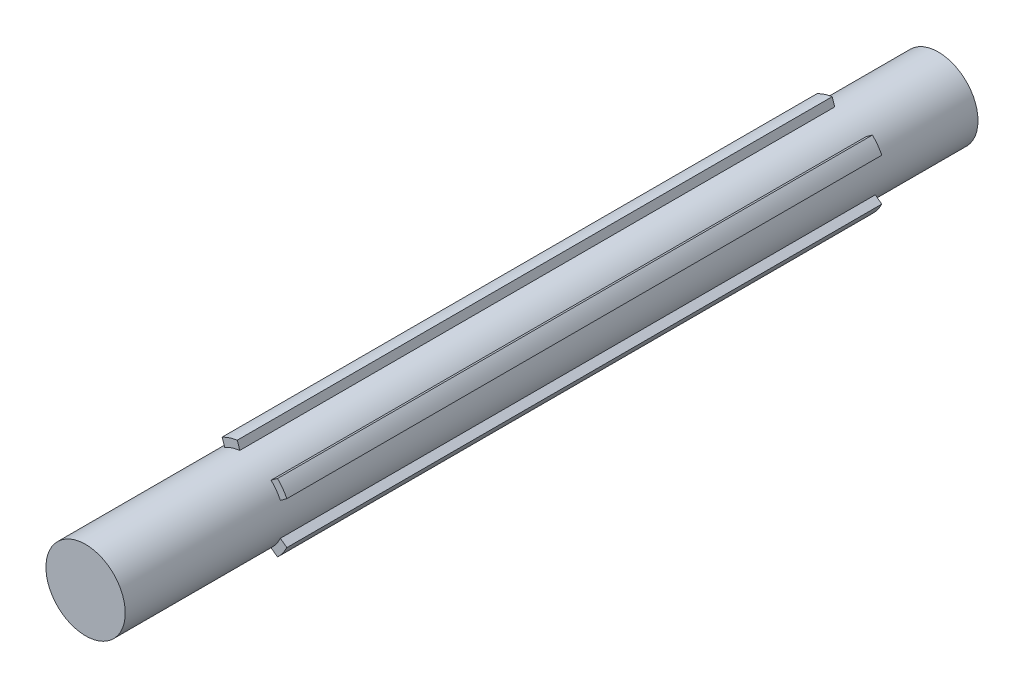
ISO-10303-21;
HEADER;
FILE_DESCRIPTION(('STEP AP214'),'2;1');
FILE_NAME('part.step','',(''),(''),'','','');
FILE_SCHEMA(('AUTOMOTIVE_DESIGN { 1 0 10303 214 1 1 1 1 }'));
ENDSEC;
DATA;
#1=APPLICATION_CONTEXT('core data for automotive mechanical design processes');
#2=APPLICATION_PROTOCOL_DEFINITION('international standard','automotive_design',2000,#1);
#3=PRODUCT_CONTEXT('',#1,'mechanical');
#4=PRODUCT('Part','Part','',(#3));
#5=PRODUCT_RELATED_PRODUCT_CATEGORY('part','',(#4));
#6=PRODUCT_DEFINITION_FORMATION('','',#4);
#7=PRODUCT_DEFINITION_CONTEXT('part definition',#1,'design');
#8=PRODUCT_DEFINITION('design','',#6,#7);
#9=PRODUCT_DEFINITION_SHAPE('','',#8);
#10=(LENGTH_UNIT() NAMED_UNIT(*) SI_UNIT(.MILLI.,.METRE.));
#11=(NAMED_UNIT(*) PLANE_ANGLE_UNIT() SI_UNIT($,.RADIAN.));
#12=(NAMED_UNIT(*) SI_UNIT($,.STERADIAN.) SOLID_ANGLE_UNIT());
#13=UNCERTAINTY_MEASURE_WITH_UNIT(LENGTH_MEASURE(1.E-05),#10,'distance_accuracy_value','');
#14=(GEOMETRIC_REPRESENTATION_CONTEXT(3) GLOBAL_UNCERTAINTY_ASSIGNED_CONTEXT((#13)) GLOBAL_UNIT_ASSIGNED_CONTEXT((#10,
#11,#12)) REPRESENTATION_CONTEXT('',''));
#15=CARTESIAN_POINT('',(0.,0.,0.));
#16=DIRECTION('',(0.,0.,1.));
#17=DIRECTION('',(1.,0.,0.));
#18=AXIS2_PLACEMENT_3D('',#15,#16,#17);
#19=CARTESIAN_POINT('',(0.,0.,-215.));
#20=DIRECTION('',(0.,0.,1.));
#21=DIRECTION('',(1.,0.,0.));
#22=AXIS2_PLACEMENT_3D('',#19,#20,#21);
#23=CYLINDRICAL_SURFACE('',#22,10.);
#24=CARTESIAN_POINT('',(0.,0.,-215.));
#25=DIRECTION('',(0.,0.,1.));
#26=DIRECTION('',(1.,0.,0.));
#27=AXIS2_PLACEMENT_3D('',#24,#25,#26);
#28=CIRCLE('',#27,10.);
#29=CARTESIAN_POINT('',(10.,0.,-215.));
#30=VERTEX_POINT('',#29);
#31=EDGE_CURVE('E11',#30,#30,#28,.T.);
#32=ORIENTED_EDGE('',*,*,#31,.T.);
#33=EDGE_LOOP('',(#32));
#34=FACE_BOUND('',#33,.T.);
#35=CARTESIAN_POINT('',(0.,0.,0.));
#36=DIRECTION('',(0.,0.,1.));
#37=DIRECTION('',(1.,0.,0.));
#38=AXIS2_PLACEMENT_3D('',#35,#36,#37);
#39=CIRCLE('',#38,10.);
#40=CARTESIAN_POINT('',(10.,0.,0.));
#41=VERTEX_POINT('',#40);
#42=EDGE_CURVE('E48',#41,#41,#39,.T.);
#43=ORIENTED_EDGE('',*,*,#42,.F.);
#44=EDGE_LOOP('',(#43));
#45=FACE_BOUND('',#44,.T.);
#46=DIRECTION('',(0.,0.,1.));
#47=VECTOR('',#46,1.);
#48=CARTESIAN_POINT('',(-9.79795897113271,-2.,-190.));
#49=LINE('',#48,#47);
#50=CARTESIAN_POINT('',(-9.79795897113271,-2.,-190.));
#51=VERTEX_POINT('',#50);
#52=CARTESIAN_POINT('',(-9.79795897113271,-2.,-40.));
#53=VERTEX_POINT('',#52);
#54=EDGE_CURVE('E392',#51,#53,#49,.T.);
#55=ORIENTED_EDGE('',*,*,#54,.F.);
#56=CARTESIAN_POINT('',(0.,0.,-190.));
#57=DIRECTION('',(0.,0.,1.));
#58=DIRECTION('',(1.,0.,0.));
#59=AXIS2_PLACEMENT_3D('',#56,#57,#58);
#60=CIRCLE('',#59,10.);
#61=CARTESIAN_POINT('',(-9.79795897113271,2.,-190.));
#62=VERTEX_POINT('',#61);
#63=EDGE_CURVE('E361',#62,#51,#60,.T.);
#64=ORIENTED_EDGE('',*,*,#63,.F.);
#65=DIRECTION('',(0.,0.,1.));
#66=VECTOR('',#65,1.);
#67=CARTESIAN_POINT('',(-9.79795897113271,2.,-190.));
#68=LINE('',#67,#66);
#69=CARTESIAN_POINT('',(-9.79795897113271,2.,-40.));
#70=VERTEX_POINT('',#69);
#71=EDGE_CURVE('E378',#62,#70,#68,.T.);
#72=ORIENTED_EDGE('',*,*,#71,.T.);
#73=CARTESIAN_POINT('',(0.,0.,-40.));
#74=DIRECTION('',(0.,0.,1.));
#75=DIRECTION('',(1.,0.,0.));
#76=AXIS2_PLACEMENT_3D('',#73,#74,#75);
#77=CIRCLE('',#76,10.);
#78=EDGE_CURVE('E352',#70,#53,#77,.T.);
#79=ORIENTED_EDGE('',*,*,#78,.T.);
#80=EDGE_LOOP('',(#55,#64,#72,#79));
#81=FACE_BOUND('',#80,.T.);
#82=DIRECTION('',(0.,0.,1.));
#83=VECTOR('',#82,1.);
#84=CARTESIAN_POINT('',(-4.92984886485877,8.70037873713845,-190.));
#85=LINE('',#84,#83);
#86=CARTESIAN_POINT('',(-4.92984886485877,8.70037873713844,-190.));
#87=VERTEX_POINT('',#86);
#88=CARTESIAN_POINT('',(-4.92984886485877,8.70037873713844,-40.));
#89=VERTEX_POINT('',#88);
#90=EDGE_CURVE('E348',#87,#89,#85,.T.);
#91=ORIENTED_EDGE('',*,*,#90,.F.);
#92=CARTESIAN_POINT('',(0.,0.,-190.));
#93=DIRECTION('',(0.,0.,1.));
#94=DIRECTION('',(1.,0.,0.));
#95=AXIS2_PLACEMENT_3D('',#92,#93,#94);
#96=CIRCLE('',#95,10.);
#97=CARTESIAN_POINT('',(-1.12562279967815,9.93644671463823,-190.));
#98=VERTEX_POINT('',#97);
#99=EDGE_CURVE('E317',#98,#87,#96,.T.);
#100=ORIENTED_EDGE('',*,*,#99,.F.);
#101=DIRECTION('',(0.,0.,1.));
#102=VECTOR('',#101,1.);
#103=CARTESIAN_POINT('',(-1.12562279967815,9.93644671463823,-190.));
#104=LINE('',#103,#102);
#105=CARTESIAN_POINT('',(-1.12562279967815,9.93644671463823,-40.));
#106=VERTEX_POINT('',#105);
#107=EDGE_CURVE('E334',#98,#106,#104,.T.);
#108=ORIENTED_EDGE('',*,*,#107,.T.);
#109=CARTESIAN_POINT('',(0.,0.,-40.));
#110=DIRECTION('',(0.,0.,1.));
#111=DIRECTION('',(1.,0.,0.));
#112=AXIS2_PLACEMENT_3D('',#109,#110,#111);
#113=CIRCLE('',#112,10.);
#114=EDGE_CURVE('E308',#106,#89,#113,.T.);
#115=ORIENTED_EDGE('',*,*,#114,.T.);
#116=EDGE_LOOP('',(#91,#100,#108,#115));
#117=FACE_BOUND('',#116,.T.);
#118=DIRECTION('',(0.,0.,1.));
#119=VECTOR('',#118,1.);
#120=CARTESIAN_POINT('',(6.75114481324993,7.3771297745484,-190.));
#121=LINE('',#120,#119);
#122=CARTESIAN_POINT('',(6.75114481324993,7.3771297745484,-190.));
#123=VERTEX_POINT('',#122);
#124=CARTESIAN_POINT('',(6.75114481324993,7.3771297745484,-40.));
#125=VERTEX_POINT('',#124);
#126=EDGE_CURVE('E304',#123,#125,#121,.T.);
#127=ORIENTED_EDGE('',*,*,#126,.F.);
#128=CARTESIAN_POINT('',(0.,0.,-190.));
#129=DIRECTION('',(0.,0.,1.));
#130=DIRECTION('',(1.,0.,0.));
#131=AXIS2_PLACEMENT_3D('',#128,#129,#130);
#132=CIRCLE('',#131,10.);
#133=CARTESIAN_POINT('',(9.10228582241981,4.1410617970486,-190.));
#134=VERTEX_POINT('',#133);
#135=EDGE_CURVE('E273',#134,#123,#132,.T.);
#136=ORIENTED_EDGE('',*,*,#135,.F.);
#137=DIRECTION('',(0.,0.,1.));
#138=VECTOR('',#137,1.);
#139=CARTESIAN_POINT('',(9.10228582241981,4.1410617970486,-190.));
#140=LINE('',#139,#138);
#141=CARTESIAN_POINT('',(9.10228582241981,4.1410617970486,-40.));
#142=VERTEX_POINT('',#141);
#143=EDGE_CURVE('E290',#134,#142,#140,.T.);
#144=ORIENTED_EDGE('',*,*,#143,.T.);
#145=CARTESIAN_POINT('',(0.,0.,-40.));
#146=DIRECTION('',(0.,0.,1.));
#147=DIRECTION('',(1.,0.,0.));
#148=AXIS2_PLACEMENT_3D('',#145,#146,#147);
#149=CIRCLE('',#148,10.);
#150=EDGE_CURVE('E264',#142,#125,#149,.T.);
#151=ORIENTED_EDGE('',*,*,#150,.T.);
#152=EDGE_LOOP('',(#127,#136,#144,#151));
#153=FACE_BOUND('',#152,.T.);
#154=DIRECTION('',(0.,0.,1.));
#155=VECTOR('',#154,1.);
#156=CARTESIAN_POINT('',(9.10228582241975,-4.14106179704873,-190.));
#157=LINE('',#156,#155);
#158=CARTESIAN_POINT('',(9.10228582241975,-4.14106179704872,-190.));
#159=VERTEX_POINT('',#158);
#160=CARTESIAN_POINT('',(9.10228582241975,-4.14106179704873,-40.));
#161=VERTEX_POINT('',#160);
#162=EDGE_CURVE('E260',#159,#161,#157,.T.);
#163=ORIENTED_EDGE('',*,*,#162,.F.);
#164=CARTESIAN_POINT('',(0.,0.,-190.));
#165=DIRECTION('',(0.,0.,1.));
#166=DIRECTION('',(1.,0.,0.));
#167=AXIS2_PLACEMENT_3D('',#164,#165,#166);
#168=CIRCLE('',#167,10.);
#169=CARTESIAN_POINT('',(6.75114481324983,-7.3771297745485,-190.));
#170=VERTEX_POINT('',#169);
#171=EDGE_CURVE('E229',#170,#159,#168,.T.);
#172=ORIENTED_EDGE('',*,*,#171,.F.);
#173=DIRECTION('',(0.,0.,1.));
#174=VECTOR('',#173,1.);
#175=CARTESIAN_POINT('',(6.75114481324983,-7.3771297745485,-190.));
#176=LINE('',#175,#174);
#177=CARTESIAN_POINT('',(6.75114481324983,-7.3771297745485,-40.));
#178=VERTEX_POINT('',#177);
#179=EDGE_CURVE('E246',#170,#178,#176,.T.);
#180=ORIENTED_EDGE('',*,*,#179,.T.);
#181=CARTESIAN_POINT('',(0.,0.,-40.));
#182=DIRECTION('',(0.,0.,1.));
#183=DIRECTION('',(1.,0.,0.));
#184=AXIS2_PLACEMENT_3D('',#181,#182,#183);
#185=CIRCLE('',#184,10.);
#186=EDGE_CURVE('E224',#178,#161,#185,.T.);
#187=ORIENTED_EDGE('',*,*,#186,.T.);
#188=EDGE_LOOP('',(#163,#172,#180,#187));
#189=FACE_BOUND('',#188,.T.);
#190=DIRECTION('',(0.,0.,1.));
#191=VECTOR('',#190,1.);
#192=CARTESIAN_POINT('',(-1.12562279967829,-9.93644671463821,-190.));
#193=LINE('',#192,#191);
#194=CARTESIAN_POINT('',(-1.12562279967829,-9.93644671463821,-190.));
#195=VERTEX_POINT('',#194);
#196=CARTESIAN_POINT('',(-1.12562279967829,-9.93644671463821,-40.));
#197=VERTEX_POINT('',#196);
#198=EDGE_CURVE('E60',#195,#197,#193,.T.);
#199=ORIENTED_EDGE('',*,*,#198,.F.);
#200=CARTESIAN_POINT('',(0.,0.,-190.));
#201=DIRECTION('',(0.,0.,1.));
#202=DIRECTION('',(1.,0.,0.));
#203=AXIS2_PLACEMENT_3D('',#200,#201,#202);
#204=CIRCLE('',#203,10.);
#205=CARTESIAN_POINT('',(-4.92984886485889,-8.70037873713838,-190.));
#206=VERTEX_POINT('',#205);
#207=EDGE_CURVE('E64',#206,#195,#204,.T.);
#208=ORIENTED_EDGE('',*,*,#207,.F.);
#209=DIRECTION('',(0.,0.,1.));
#210=VECTOR('',#209,1.);
#211=CARTESIAN_POINT('',(-4.92984886485889,-8.70037873713838,-190.));
#212=LINE('',#211,#210);
#213=CARTESIAN_POINT('',(-4.92984886485889,-8.70037873713838,-40.));
#214=VERTEX_POINT('',#213);
#215=EDGE_CURVE('E193',#206,#214,#212,.T.);
#216=ORIENTED_EDGE('',*,*,#215,.T.);
#217=CARTESIAN_POINT('',(0.,0.,-40.));
#218=DIRECTION('',(0.,0.,1.));
#219=DIRECTION('',(1.,0.,0.));
#220=AXIS2_PLACEMENT_3D('',#217,#218,#219);
#221=CIRCLE('',#220,10.);
#222=EDGE_CURVE('E210',#214,#197,#221,.T.);
#223=ORIENTED_EDGE('',*,*,#222,.T.);
#224=EDGE_LOOP('',(#199,#208,#216,#223));
#225=FACE_BOUND('',#224,.T.);
#226=ADVANCED_FACE('F45',(#34,#45,#81,#117,#153,#189,#225),#23,.T.);
#227=CARTESIAN_POINT('',(0.,0.,-215.));
#228=DIRECTION('',(0.,0.,1.));
#229=DIRECTION('',(1.,0.,0.));
#230=AXIS2_PLACEMENT_3D('',#227,#228,#229);
#231=PLANE('',#230);
#232=ORIENTED_EDGE('',*,*,#31,.F.);
#233=EDGE_LOOP('',(#232));
#234=FACE_BOUND('',#233,.T.);
#235=ADVANCED_FACE('F433',(#234),#231,.F.);
#236=CARTESIAN_POINT('',(0.,0.,0.));
#237=DIRECTION('',(0.,0.,1.));
#238=DIRECTION('',(1.,0.,0.));
#239=AXIS2_PLACEMENT_3D('',#236,#237,#238);
#240=PLANE('',#239);
#241=ORIENTED_EDGE('',*,*,#42,.T.);
#242=EDGE_LOOP('',(#241));
#243=FACE_BOUND('',#242,.T.);
#244=ADVANCED_FACE('F430',(#243),#240,.T.);
#245=CARTESIAN_POINT('',(0.,-2.,-190.));
#246=DIRECTION('',(0.,-1.,0.));
#247=DIRECTION('',(0.,0.,-1.));
#248=AXIS2_PLACEMENT_3D('',#245,#246,#247);
#249=PLANE('',#248);
#250=DIRECTION('',(1.,0.,0.));
#251=VECTOR('',#250,1.);
#252=CARTESIAN_POINT('',(0.,-2.,-40.));
#253=LINE('',#252,#251);
#254=CARTESIAN_POINT('',(-11.8321595661992,-2.,-40.));
#255=VERTEX_POINT('',#254);
#256=EDGE_CURVE('E366',#255,#53,#253,.T.);
#257=ORIENTED_EDGE('',*,*,#256,.F.);
#258=DIRECTION('',(0.,0.,1.));
#259=VECTOR('',#258,1.);
#260=CARTESIAN_POINT('',(-11.8321595661992,-2.,-190.));
#261=LINE('',#260,#259);
#262=CARTESIAN_POINT('',(-11.8321595661992,-2.,-190.));
#263=VERTEX_POINT('',#262);
#264=EDGE_CURVE('E396',#263,#255,#261,.T.);
#265=ORIENTED_EDGE('',*,*,#264,.F.);
#266=DIRECTION('',(1.,0.,0.));
#267=VECTOR('',#266,1.);
#268=CARTESIAN_POINT('',(0.,-2.,-190.));
#269=LINE('',#268,#267);
#270=EDGE_CURVE('E374',#263,#51,#269,.T.);
#271=ORIENTED_EDGE('',*,*,#270,.T.);
#272=ORIENTED_EDGE('',*,*,#54,.T.);
#273=EDGE_LOOP('',(#257,#265,#271,#272));
#274=FACE_BOUND('',#273,.T.);
#275=ADVANCED_FACE('F416',(#274),#249,.T.);
#276=CARTESIAN_POINT('',(0.,0.,-190.));
#277=DIRECTION('',(0.,0.,1.));
#278=DIRECTION('',(1.,0.,0.));
#279=AXIS2_PLACEMENT_3D('',#276,#277,#278);
#280=CYLINDRICAL_SURFACE('',#279,12.);
#281=CARTESIAN_POINT('',(0.,0.,-40.));
#282=DIRECTION('',(0.,0.,1.));
#283=DIRECTION('',(1.,0.,0.));
#284=AXIS2_PLACEMENT_3D('',#281,#282,#283);
#285=CIRCLE('',#284,12.);
#286=CARTESIAN_POINT('',(-11.8321595661992,2.,-40.));
#287=VERTEX_POINT('',#286);
#288=EDGE_CURVE('E385',#287,#255,#285,.T.);
#289=ORIENTED_EDGE('',*,*,#288,.F.);
#290=DIRECTION('',(0.,0.,1.));
#291=VECTOR('',#290,1.);
#292=CARTESIAN_POINT('',(-11.8321595661992,2.,-190.));
#293=LINE('',#292,#291);
#294=CARTESIAN_POINT('',(-11.8321595661992,2.,-190.));
#295=VERTEX_POINT('',#294);
#296=EDGE_CURVE('E399',#295,#287,#293,.T.);
#297=ORIENTED_EDGE('',*,*,#296,.F.);
#298=CARTESIAN_POINT('',(0.,0.,-190.));
#299=DIRECTION('',(0.,0.,1.));
#300=DIRECTION('',(1.,0.,0.));
#301=AXIS2_PLACEMENT_3D('',#298,#299,#300);
#302=CIRCLE('',#301,12.);
#303=EDGE_CURVE('E370',#295,#263,#302,.T.);
#304=ORIENTED_EDGE('',*,*,#303,.T.);
#305=ORIENTED_EDGE('',*,*,#264,.T.);
#306=EDGE_LOOP('',(#289,#297,#304,#305));
#307=FACE_BOUND('',#306,.T.);
#308=ADVANCED_FACE('F422',(#307),#280,.T.);
#309=CARTESIAN_POINT('',(0.,2.,-190.));
#310=DIRECTION('',(0.,-1.,0.));
#311=DIRECTION('',(0.,0.,-1.));
#312=AXIS2_PLACEMENT_3D('',#309,#310,#311);
#313=PLANE('',#312);
#314=DIRECTION('',(1.,0.,0.));
#315=VECTOR('',#314,1.);
#316=CARTESIAN_POINT('',(0.,2.,-40.));
#317=LINE('',#316,#315);
#318=EDGE_CURVE('E381',#287,#70,#317,.T.);
#319=ORIENTED_EDGE('',*,*,#318,.T.);
#320=ORIENTED_EDGE('',*,*,#71,.F.);
#321=DIRECTION('',(1.,0.,0.));
#322=VECTOR('',#321,1.);
#323=CARTESIAN_POINT('',(0.,2.,-190.));
#324=LINE('',#323,#322);
#325=EDGE_CURVE('E365',#295,#62,#324,.T.);
#326=ORIENTED_EDGE('',*,*,#325,.F.);
#327=ORIENTED_EDGE('',*,*,#296,.T.);
#328=EDGE_LOOP('',(#319,#320,#326,#327));
#329=FACE_BOUND('',#328,.T.);
#330=ADVANCED_FACE('F410',(#329),#313,.F.);
#331=CARTESIAN_POINT('',(0.,0.,-190.));
#332=DIRECTION('',(0.,0.,1.));
#333=DIRECTION('',(1.,0.,0.));
#334=AXIS2_PLACEMENT_3D('',#331,#332,#333);
#335=PLANE('',#334);
#336=ORIENTED_EDGE('',*,*,#63,.T.);
#337=ORIENTED_EDGE('',*,*,#270,.F.);
#338=ORIENTED_EDGE('',*,*,#303,.F.);
#339=ORIENTED_EDGE('',*,*,#325,.T.);
#340=EDGE_LOOP('',(#336,#337,#338,#339));
#341=FACE_BOUND('',#340,.T.);
#342=ADVANCED_FACE('F419',(#341),#335,.F.);
#343=CARTESIAN_POINT('',(0.,0.,-40.));
#344=DIRECTION('',(0.,0.,1.));
#345=DIRECTION('',(1.,0.,0.));
#346=AXIS2_PLACEMENT_3D('',#343,#344,#345);
#347=PLANE('',#346);
#348=ORIENTED_EDGE('',*,*,#78,.F.);
#349=ORIENTED_EDGE('',*,*,#318,.F.);
#350=ORIENTED_EDGE('',*,*,#288,.T.);
#351=ORIENTED_EDGE('',*,*,#256,.T.);
#352=EDGE_LOOP('',(#348,#349,#350,#351));
#353=FACE_BOUND('',#352,.T.);
#354=ADVANCED_FACE('F413',(#353),#347,.T.);
#355=CARTESIAN_POINT('',(-1.90211303259031,-0.61803398874989,-190.));
#356=DIRECTION('',(-0.951056516295154,-0.309016994374945,0.));
#357=DIRECTION('',(0.309016994374945,-0.951056516295155,0.));
#358=AXIS2_PLACEMENT_3D('',#355,#356,#357);
#359=PLANE('',#358);
#360=DIRECTION('',(0.309016994374945,-0.951056516295155,0.));
#361=VECTOR('',#360,1.);
#362=CARTESIAN_POINT('',(-1.90211303259031,-0.61803398874989,-40.));
#363=LINE('',#362,#361);
#364=CARTESIAN_POINT('',(-5.55845141870195,10.6350184685279,-40.));
#365=VERTEX_POINT('',#364);
#366=EDGE_CURVE('E322',#365,#89,#363,.T.);
#367=ORIENTED_EDGE('',*,*,#366,.F.);
#368=DIRECTION('',(0.,0.,1.));
#369=VECTOR('',#368,1.);
#370=CARTESIAN_POINT('',(-5.55845141870195,10.6350184685279,-190.));
#371=LINE('',#370,#369);
#372=CARTESIAN_POINT('',(-5.55845141870195,10.6350184685279,-190.));
#373=VERTEX_POINT('',#372);
#374=EDGE_CURVE('E353',#373,#365,#371,.T.);
#375=ORIENTED_EDGE('',*,*,#374,.F.);
#376=DIRECTION('',(0.309016994374945,-0.951056516295155,0.));
#377=VECTOR('',#376,1.);
#378=CARTESIAN_POINT('',(-1.90211303259031,-0.61803398874989,-190.));
#379=LINE('',#378,#377);
#380=EDGE_CURVE('E330',#373,#87,#379,.T.);
#381=ORIENTED_EDGE('',*,*,#380,.T.);
#382=ORIENTED_EDGE('',*,*,#90,.T.);
#383=EDGE_LOOP('',(#367,#375,#381,#382));
#384=FACE_BOUND('',#383,.T.);
#385=ADVANCED_FACE('F489',(#384),#359,.T.);
#386=CARTESIAN_POINT('',(0.,0.,-190.));
#387=DIRECTION('',(0.,0.,1.));
#388=DIRECTION('',(1.,0.,0.));
#389=AXIS2_PLACEMENT_3D('',#386,#387,#388);
#390=CYLINDRICAL_SURFACE('',#389,12.);
#391=CARTESIAN_POINT('',(0.,0.,-40.));
#392=DIRECTION('',(0.,0.,1.));
#393=DIRECTION('',(1.,0.,0.));
#394=AXIS2_PLACEMENT_3D('',#391,#392,#393);
#395=CIRCLE('',#394,12.);
#396=CARTESIAN_POINT('',(-1.75422535352133,11.8710864460277,-40.));
#397=VERTEX_POINT('',#396);
#398=EDGE_CURVE('E341',#397,#365,#395,.T.);
#399=ORIENTED_EDGE('',*,*,#398,.F.);
#400=DIRECTION('',(0.,0.,1.));
#401=VECTOR('',#400,1.);
#402=CARTESIAN_POINT('',(-1.75422535352133,11.8710864460277,-190.));
#403=LINE('',#402,#401);
#404=CARTESIAN_POINT('',(-1.75422535352133,11.8710864460277,-190.));
#405=VERTEX_POINT('',#404);
#406=EDGE_CURVE('E356',#405,#397,#403,.T.);
#407=ORIENTED_EDGE('',*,*,#406,.F.);
#408=CARTESIAN_POINT('',(0.,0.,-190.));
#409=DIRECTION('',(0.,0.,1.));
#410=DIRECTION('',(1.,0.,0.));
#411=AXIS2_PLACEMENT_3D('',#408,#409,#410);
#412=CIRCLE('',#411,12.);
#413=EDGE_CURVE('E326',#405,#373,#412,.T.);
#414=ORIENTED_EDGE('',*,*,#413,.T.);
#415=ORIENTED_EDGE('',*,*,#374,.T.);
#416=EDGE_LOOP('',(#399,#407,#414,#415));
#417=FACE_BOUND('',#416,.T.);
#418=ADVANCED_FACE('F499',(#417),#390,.T.);
#419=CARTESIAN_POINT('',(1.90211303259031,0.618033988749889,-190.));
#420=DIRECTION('',(-0.951056516295155,-0.309016994374945,0.));
#421=DIRECTION('',(0.309016994374945,-0.951056516295155,0.));
#422=AXIS2_PLACEMENT_3D('',#419,#420,#421);
#423=PLANE('',#422);
#424=DIRECTION('',(0.309016994374945,-0.951056516295155,0.));
#425=VECTOR('',#424,1.);
#426=CARTESIAN_POINT('',(1.90211303259031,0.618033988749889,-40.));
#427=LINE('',#426,#425);
#428=EDGE_CURVE('E337',#397,#106,#427,.T.);
#429=ORIENTED_EDGE('',*,*,#428,.T.);
#430=ORIENTED_EDGE('',*,*,#107,.F.);
#431=DIRECTION('',(0.309016994374945,-0.951056516295155,0.));
#432=VECTOR('',#431,1.);
#433=CARTESIAN_POINT('',(1.90211303259031,0.618033988749889,-190.));
#434=LINE('',#433,#432);
#435=EDGE_CURVE('E321',#405,#98,#434,.T.);
#436=ORIENTED_EDGE('',*,*,#435,.F.);
#437=ORIENTED_EDGE('',*,*,#406,.T.);
#438=EDGE_LOOP('',(#429,#430,#436,#437));
#439=FACE_BOUND('',#438,.T.);
#440=ADVANCED_FACE('F510',(#439),#423,.F.);
#441=CARTESIAN_POINT('',(0.,0.,-190.));
#442=DIRECTION('',(0.,0.,1.));
#443=DIRECTION('',(1.,0.,0.));
#444=AXIS2_PLACEMENT_3D('',#441,#442,#443);
#445=PLANE('',#444);
#446=ORIENTED_EDGE('',*,*,#99,.T.);
#447=ORIENTED_EDGE('',*,*,#380,.F.);
#448=ORIENTED_EDGE('',*,*,#413,.F.);
#449=ORIENTED_EDGE('',*,*,#435,.T.);
#450=EDGE_LOOP('',(#446,#447,#448,#449));
#451=FACE_BOUND('',#450,.T.);
#452=ADVANCED_FACE('F521',(#451),#445,.F.);
#453=CARTESIAN_POINT('',(0.,0.,-40.));
#454=DIRECTION('',(0.,0.,1.));
#455=DIRECTION('',(1.,0.,0.));
#456=AXIS2_PLACEMENT_3D('',#453,#454,#455);
#457=PLANE('',#456);
#458=ORIENTED_EDGE('',*,*,#114,.F.);
#459=ORIENTED_EDGE('',*,*,#428,.F.);
#460=ORIENTED_EDGE('',*,*,#398,.T.);
#461=ORIENTED_EDGE('',*,*,#366,.T.);
#462=EDGE_LOOP('',(#458,#459,#460,#461));
#463=FACE_BOUND('',#462,.T.);
#464=ADVANCED_FACE('F532',(#463),#457,.T.);
#465=CARTESIAN_POINT('',(-1.17557050458494,1.6180339887499,-190.));
#466=DIRECTION('',(-0.587785252292469,0.809016994374951,0.));
#467=DIRECTION('',(-0.809016994374951,-0.587785252292469,0.));
#468=AXIS2_PLACEMENT_3D('',#465,#466,#467);
#469=PLANE('',#468);
#470=DIRECTION('',(-0.809016994374951,-0.587785252292469,0.));
#471=VECTOR('',#470,1.);
#472=CARTESIAN_POINT('',(-1.17557050458494,1.6180339887499,-40.));
#473=LINE('',#472,#471);
#474=CARTESIAN_POINT('',(8.39684766462639,8.57280288453307,-40.));
#475=VERTEX_POINT('',#474);
#476=EDGE_CURVE('E278',#475,#125,#473,.T.);
#477=ORIENTED_EDGE('',*,*,#476,.F.);
#478=DIRECTION('',(0.,0.,1.));
#479=VECTOR('',#478,1.);
#480=CARTESIAN_POINT('',(8.39684766462639,8.57280288453307,-190.));
#481=LINE('',#480,#479);
#482=CARTESIAN_POINT('',(8.39684766462639,8.57280288453307,-190.));
#483=VERTEX_POINT('',#482);
#484=EDGE_CURVE('E309',#483,#475,#481,.T.);
#485=ORIENTED_EDGE('',*,*,#484,.F.);
#486=DIRECTION('',(-0.809016994374951,-0.587785252292469,0.));
#487=VECTOR('',#486,1.);
#488=CARTESIAN_POINT('',(-1.17557050458494,1.6180339887499,-190.));
#489=LINE('',#488,#487);
#490=EDGE_CURVE('E286',#483,#123,#489,.T.);
#491=ORIENTED_EDGE('',*,*,#490,.T.);
#492=ORIENTED_EDGE('',*,*,#126,.T.);
#493=EDGE_LOOP('',(#477,#485,#491,#492));
#494=FACE_BOUND('',#493,.T.);
#495=ADVANCED_FACE('F543',(#494),#469,.T.);
#496=CARTESIAN_POINT('',(0.,0.,-190.));
#497=DIRECTION('',(0.,0.,1.));
#498=DIRECTION('',(1.,0.,0.));
#499=AXIS2_PLACEMENT_3D('',#496,#497,#498);
#500=CYLINDRICAL_SURFACE('',#499,12.);
#501=CARTESIAN_POINT('',(0.,0.,-40.));
#502=DIRECTION('',(0.,0.,1.));
#503=DIRECTION('',(1.,0.,0.));
#504=AXIS2_PLACEMENT_3D('',#501,#502,#503);
#505=CIRCLE('',#504,12.);
#506=CARTESIAN_POINT('',(10.7479886737963,5.33673490703326,-40.));
#507=VERTEX_POINT('',#506);
#508=EDGE_CURVE('E297',#507,#475,#505,.T.);
#509=ORIENTED_EDGE('',*,*,#508,.F.);
#510=DIRECTION('',(0.,0.,1.));
#511=VECTOR('',#510,1.);
#512=CARTESIAN_POINT('',(10.7479886737963,5.33673490703326,-190.));
#513=LINE('',#512,#511);
#514=CARTESIAN_POINT('',(10.7479886737963,5.33673490703326,-190.));
#515=VERTEX_POINT('',#514);
#516=EDGE_CURVE('E312',#515,#507,#513,.T.);
#517=ORIENTED_EDGE('',*,*,#516,.F.);
#518=CARTESIAN_POINT('',(0.,0.,-190.));
#519=DIRECTION('',(0.,0.,1.));
#520=DIRECTION('',(1.,0.,0.));
#521=AXIS2_PLACEMENT_3D('',#518,#519,#520);
#522=CIRCLE('',#521,12.);
#523=EDGE_CURVE('E282',#515,#483,#522,.T.);
#524=ORIENTED_EDGE('',*,*,#523,.T.);
#525=ORIENTED_EDGE('',*,*,#484,.T.);
#526=EDGE_LOOP('',(#509,#517,#524,#525));
#527=FACE_BOUND('',#526,.T.);
#528=ADVANCED_FACE('F554',(#527),#500,.T.);
#529=CARTESIAN_POINT('',(1.17557050458493,-1.6180339887499,-190.));
#530=DIRECTION('',(-0.587785252292468,0.809016994374951,0.));
#531=DIRECTION('',(-0.809016994374951,-0.587785252292468,0.));
#532=AXIS2_PLACEMENT_3D('',#529,#530,#531);
#533=PLANE('',#532);
#534=DIRECTION('',(-0.809016994374951,-0.587785252292468,0.));
#535=VECTOR('',#534,1.);
#536=CARTESIAN_POINT('',(1.17557050458493,-1.6180339887499,-40.));
#537=LINE('',#536,#535);
#538=EDGE_CURVE('E293',#507,#142,#537,.T.);
#539=ORIENTED_EDGE('',*,*,#538,.T.);
#540=ORIENTED_EDGE('',*,*,#143,.F.);
#541=DIRECTION('',(-0.809016994374951,-0.587785252292468,0.));
#542=VECTOR('',#541,1.);
#543=CARTESIAN_POINT('',(1.17557050458493,-1.6180339887499,-190.));
#544=LINE('',#543,#542);
#545=EDGE_CURVE('E277',#515,#134,#544,.T.);
#546=ORIENTED_EDGE('',*,*,#545,.F.);
#547=ORIENTED_EDGE('',*,*,#516,.T.);
#548=EDGE_LOOP('',(#539,#540,#546,#547));
#549=FACE_BOUND('',#548,.T.);
#550=ADVANCED_FACE('F565',(#549),#533,.F.);
#551=CARTESIAN_POINT('',(0.,0.,-190.));
#552=DIRECTION('',(0.,0.,1.));
#553=DIRECTION('',(1.,0.,0.));
#554=AXIS2_PLACEMENT_3D('',#551,#552,#553);
#555=PLANE('',#554);
#556=ORIENTED_EDGE('',*,*,#135,.T.);
#557=ORIENTED_EDGE('',*,*,#490,.F.);
#558=ORIENTED_EDGE('',*,*,#523,.F.);
#559=ORIENTED_EDGE('',*,*,#545,.T.);
#560=EDGE_LOOP('',(#556,#557,#558,#559));
#561=FACE_BOUND('',#560,.T.);
#562=ADVANCED_FACE('F576',(#561),#555,.F.);
#563=CARTESIAN_POINT('',(0.,0.,-40.));
#564=DIRECTION('',(0.,0.,1.));
#565=DIRECTION('',(1.,0.,0.));
#566=AXIS2_PLACEMENT_3D('',#563,#564,#565);
#567=PLANE('',#566);
#568=ORIENTED_EDGE('',*,*,#150,.F.);
#569=ORIENTED_EDGE('',*,*,#538,.F.);
#570=ORIENTED_EDGE('',*,*,#508,.T.);
#571=ORIENTED_EDGE('',*,*,#476,.T.);
#572=EDGE_LOOP('',(#568,#569,#570,#571));
#573=FACE_BOUND('',#572,.T.);
#574=ADVANCED_FACE('F587',(#573),#567,.T.);
#575=CARTESIAN_POINT('',(1.17557050458496,1.61803398874989,-190.));
#576=DIRECTION('',(0.58778525229248,0.809016994374942,0.));
#577=DIRECTION('',(-0.809016994374942,0.58778525229248,0.));
#578=AXIS2_PLACEMENT_3D('',#575,#576,#577);
#579=PLANE('',#578);
#580=DIRECTION('',(-0.809016994374942,0.58778525229248,0.));
#581=VECTOR('',#580,1.);
#582=CARTESIAN_POINT('',(1.17557050458496,1.61803398874989,-40.));
#583=LINE('',#582,#581);
#584=CARTESIAN_POINT('',(10.7479886737962,-5.33673490703341,-40.));
#585=VERTEX_POINT('',#584);
#586=EDGE_CURVE('E234',#585,#161,#583,.T.);
#587=ORIENTED_EDGE('',*,*,#586,.F.);
#588=DIRECTION('',(0.,0.,1.));
#589=VECTOR('',#588,1.);
#590=CARTESIAN_POINT('',(10.7479886737962,-5.33673490703341,-190.));
#591=LINE('',#590,#589);
#592=CARTESIAN_POINT('',(10.7479886737962,-5.33673490703341,-190.));
#593=VERTEX_POINT('',#592);
#594=EDGE_CURVE('E265',#593,#585,#591,.T.);
#595=ORIENTED_EDGE('',*,*,#594,.F.);
#596=DIRECTION('',(-0.809016994374942,0.58778525229248,0.));
#597=VECTOR('',#596,1.);
#598=CARTESIAN_POINT('',(1.17557050458496,1.61803398874989,-190.));
#599=LINE('',#598,#597);
#600=EDGE_CURVE('E242',#593,#159,#599,.T.);
#601=ORIENTED_EDGE('',*,*,#600,.T.);
#602=ORIENTED_EDGE('',*,*,#162,.T.);
#603=EDGE_LOOP('',(#587,#595,#601,#602));
#604=FACE_BOUND('',#603,.T.);
#605=ADVANCED_FACE('F598',(#604),#579,.T.);
#606=CARTESIAN_POINT('',(0.,0.,-190.));
#607=DIRECTION('',(0.,0.,1.));
#608=DIRECTION('',(1.,0.,0.));
#609=AXIS2_PLACEMENT_3D('',#606,#607,#608);
#610=CYLINDRICAL_SURFACE('',#609,12.);
#611=CARTESIAN_POINT('',(0.,0.,-40.));
#612=DIRECTION('',(0.,0.,1.));
#613=DIRECTION('',(1.,0.,0.));
#614=AXIS2_PLACEMENT_3D('',#611,#612,#613);
#615=CIRCLE('',#614,12.);
#616=CARTESIAN_POINT('',(8.39684766462627,-8.57280288453318,-40.));
#617=VERTEX_POINT('',#616);
#618=EDGE_CURVE('E253',#617,#585,#615,.T.);
#619=ORIENTED_EDGE('',*,*,#618,.F.);
#620=DIRECTION('',(0.,0.,1.));
#621=VECTOR('',#620,1.);
#622=CARTESIAN_POINT('',(8.39684766462627,-8.57280288453318,-190.));
#623=LINE('',#622,#621);
#624=CARTESIAN_POINT('',(8.39684766462627,-8.57280288453318,-190.));
#625=VERTEX_POINT('',#624);
#626=EDGE_CURVE('E268',#625,#617,#623,.T.);
#627=ORIENTED_EDGE('',*,*,#626,.F.);
#628=CARTESIAN_POINT('',(0.,0.,-190.));
#629=DIRECTION('',(0.,0.,1.));
#630=DIRECTION('',(1.,0.,0.));
#631=AXIS2_PLACEMENT_3D('',#628,#629,#630);
#632=CIRCLE('',#631,12.);
#633=EDGE_CURVE('E238',#625,#593,#632,.T.);
#634=ORIENTED_EDGE('',*,*,#633,.T.);
#635=ORIENTED_EDGE('',*,*,#594,.T.);
#636=EDGE_LOOP('',(#619,#627,#634,#635));
#637=FACE_BOUND('',#636,.T.);
#638=ADVANCED_FACE('F609',(#637),#610,.T.);
#639=CARTESIAN_POINT('',(-1.17557050458496,-1.61803398874989,-190.));
#640=DIRECTION('',(0.58778525229248,0.809016994374942,0.));
#641=DIRECTION('',(-0.809016994374943,0.58778525229248,0.));
#642=AXIS2_PLACEMENT_3D('',#639,#640,#641);
#643=PLANE('',#642);
#644=DIRECTION('',(-0.809016994374943,0.58778525229248,0.));
#645=VECTOR('',#644,1.);
#646=CARTESIAN_POINT('',(-1.17557050458496,-1.61803398874989,-40.));
#647=LINE('',#646,#645);
#648=EDGE_CURVE('E249',#617,#178,#647,.T.);
#649=ORIENTED_EDGE('',*,*,#648,.T.);
#650=ORIENTED_EDGE('',*,*,#179,.F.);
#651=DIRECTION('',(-0.809016994374943,0.58778525229248,0.));
#652=VECTOR('',#651,1.);
#653=CARTESIAN_POINT('',(-1.17557050458496,-1.61803398874989,-190.));
#654=LINE('',#653,#652);
#655=EDGE_CURVE('E233',#625,#170,#654,.T.);
#656=ORIENTED_EDGE('',*,*,#655,.F.);
#657=ORIENTED_EDGE('',*,*,#626,.T.);
#658=EDGE_LOOP('',(#649,#650,#656,#657));
#659=FACE_BOUND('',#658,.T.);
#660=ADVANCED_FACE('F620',(#659),#643,.F.);
#661=CARTESIAN_POINT('',(0.,0.,-190.));
#662=DIRECTION('',(0.,0.,1.));
#663=DIRECTION('',(1.,0.,0.));
#664=AXIS2_PLACEMENT_3D('',#661,#662,#663);
#665=PLANE('',#664);
#666=ORIENTED_EDGE('',*,*,#171,.T.);
#667=ORIENTED_EDGE('',*,*,#600,.F.);
#668=ORIENTED_EDGE('',*,*,#633,.F.);
#669=ORIENTED_EDGE('',*,*,#655,.T.);
#670=EDGE_LOOP('',(#666,#667,#668,#669));
#671=FACE_BOUND('',#670,.T.);
#672=ADVANCED_FACE('F631',(#671),#665,.F.);
#673=CARTESIAN_POINT('',(0.,0.,-40.));
#674=DIRECTION('',(0.,0.,1.));
#675=DIRECTION('',(1.,0.,0.));
#676=AXIS2_PLACEMENT_3D('',#673,#674,#675);
#677=PLANE('',#676);
#678=ORIENTED_EDGE('',*,*,#186,.F.);
#679=ORIENTED_EDGE('',*,*,#648,.F.);
#680=ORIENTED_EDGE('',*,*,#618,.T.);
#681=ORIENTED_EDGE('',*,*,#586,.T.);
#682=EDGE_LOOP('',(#678,#679,#680,#681));
#683=FACE_BOUND('',#682,.T.);
#684=ADVANCED_FACE('F642',(#683),#677,.T.);
#685=CARTESIAN_POINT('',(1.9021130325903,-0.618033988749917,-190.));
#686=DIRECTION('',(0.95105651629515,-0.309016994374958,0.));
#687=DIRECTION('',(0.309016994374958,0.95105651629515,0.));
#688=AXIS2_PLACEMENT_3D('',#685,#686,#687);
#689=PLANE('',#688);
#690=DIRECTION('',(0.309016994374958,0.95105651629515,0.));
#691=VECTOR('',#690,1.);
#692=CARTESIAN_POINT('',(1.9021130325903,-0.618033988749917,-40.));
#693=LINE('',#692,#691);
#694=CARTESIAN_POINT('',(-1.75422535352149,-11.8710864460277,-40.));
#695=VERTEX_POINT('',#694);
#696=EDGE_CURVE('E218',#695,#197,#693,.T.);
#697=ORIENTED_EDGE('',*,*,#696,.F.);
#698=DIRECTION('',(0.,0.,1.));
#699=VECTOR('',#698,1.);
#700=CARTESIAN_POINT('',(-1.75422535352149,-11.8710864460277,-190.));
#701=LINE('',#700,#699);
#702=CARTESIAN_POINT('',(-1.75422535352149,-11.8710864460277,-190.));
#703=VERTEX_POINT('',#702);
#704=EDGE_CURVE('E192',#703,#695,#701,.T.);
#705=ORIENTED_EDGE('',*,*,#704,.F.);
#706=DIRECTION('',(0.309016994374958,0.95105651629515,0.));
#707=VECTOR('',#706,1.);
#708=CARTESIAN_POINT('',(1.9021130325903,-0.618033988749917,-190.));
#709=LINE('',#708,#707);
#710=EDGE_CURVE('E203',#703,#195,#709,.T.);
#711=ORIENTED_EDGE('',*,*,#710,.T.);
#712=ORIENTED_EDGE('',*,*,#198,.T.);
#713=EDGE_LOOP('',(#697,#705,#711,#712));
#714=FACE_BOUND('',#713,.T.);
#715=ADVANCED_FACE('F653',(#714),#689,.T.);
#716=CARTESIAN_POINT('',(0.,0.,-190.));
#717=DIRECTION('',(0.,0.,1.));
#718=DIRECTION('',(1.,0.,0.));
#719=AXIS2_PLACEMENT_3D('',#716,#717,#718);
#720=CYLINDRICAL_SURFACE('',#719,12.);
#721=CARTESIAN_POINT('',(0.,0.,-40.));
#722=DIRECTION('',(0.,0.,1.));
#723=DIRECTION('',(1.,0.,0.));
#724=AXIS2_PLACEMENT_3D('',#721,#722,#723);
#725=CIRCLE('',#724,12.);
#726=CARTESIAN_POINT('',(-5.5584514187021,-10.6350184685279,-40.));
#727=VERTEX_POINT('',#726);
#728=EDGE_CURVE('E187',#727,#695,#725,.T.);
#729=ORIENTED_EDGE('',*,*,#728,.F.);
#730=DIRECTION('',(0.,0.,1.));
#731=VECTOR('',#730,1.);
#732=CARTESIAN_POINT('',(-5.5584514187021,-10.6350184685279,-190.));
#733=LINE('',#732,#731);
#734=CARTESIAN_POINT('',(-5.5584514187021,-10.6350184685279,-190.));
#735=VERTEX_POINT('',#734);
#736=EDGE_CURVE('E180',#735,#727,#733,.T.);
#737=ORIENTED_EDGE('',*,*,#736,.F.);
#738=CARTESIAN_POINT('',(0.,0.,-190.));
#739=DIRECTION('',(0.,0.,1.));
#740=DIRECTION('',(1.,0.,0.));
#741=AXIS2_PLACEMENT_3D('',#738,#739,#740);
#742=CIRCLE('',#741,12.);
#743=EDGE_CURVE('E184',#735,#703,#742,.T.);
#744=ORIENTED_EDGE('',*,*,#743,.T.);
#745=ORIENTED_EDGE('',*,*,#704,.T.);
#746=EDGE_LOOP('',(#729,#737,#744,#745));
#747=FACE_BOUND('',#746,.T.);
#748=ADVANCED_FACE('F182',(#747),#720,.T.);
#749=CARTESIAN_POINT('',(-1.9021130325903,0.618033988749916,-190.));
#750=DIRECTION('',(0.95105651629515,-0.309016994374958,0.));
#751=DIRECTION('',(0.309016994374958,0.95105651629515,0.));
#752=AXIS2_PLACEMENT_3D('',#749,#750,#751);
#753=PLANE('',#752);
#754=DIRECTION('',(0.309016994374958,0.95105651629515,0.));
#755=VECTOR('',#754,1.);
#756=CARTESIAN_POINT('',(-1.9021130325903,0.618033988749916,-40.));
#757=LINE('',#756,#755);
#758=EDGE_CURVE('E213',#727,#214,#757,.T.);
#759=ORIENTED_EDGE('',*,*,#758,.T.);
#760=ORIENTED_EDGE('',*,*,#215,.F.);
#761=DIRECTION('',(0.309016994374958,0.95105651629515,0.));
#762=VECTOR('',#761,1.);
#763=CARTESIAN_POINT('',(-1.9021130325903,0.618033988749916,-190.));
#764=LINE('',#763,#762);
#765=EDGE_CURVE('E196',#735,#206,#764,.T.);
#766=ORIENTED_EDGE('',*,*,#765,.F.);
#767=ORIENTED_EDGE('',*,*,#736,.T.);
#768=EDGE_LOOP('',(#759,#760,#766,#767));
#769=FACE_BOUND('',#768,.T.);
#770=ADVANCED_FACE('F197',(#769),#753,.F.);
#771=CARTESIAN_POINT('',(0.,0.,-190.));
#772=DIRECTION('',(0.,0.,1.));
#773=DIRECTION('',(1.,0.,0.));
#774=AXIS2_PLACEMENT_3D('',#771,#772,#773);
#775=PLANE('',#774);
#776=ORIENTED_EDGE('',*,*,#207,.T.);
#777=ORIENTED_EDGE('',*,*,#710,.F.);
#778=ORIENTED_EDGE('',*,*,#743,.F.);
#779=ORIENTED_EDGE('',*,*,#765,.T.);
#780=EDGE_LOOP('',(#776,#777,#778,#779));
#781=FACE_BOUND('',#780,.T.);
#782=ADVANCED_FACE('F201',(#781),#775,.F.);
#783=CARTESIAN_POINT('',(0.,0.,-40.));
#784=DIRECTION('',(0.,0.,1.));
#785=DIRECTION('',(1.,0.,0.));
#786=AXIS2_PLACEMENT_3D('',#783,#784,#785);
#787=PLANE('',#786);
#788=ORIENTED_EDGE('',*,*,#222,.F.);
#789=ORIENTED_EDGE('',*,*,#758,.F.);
#790=ORIENTED_EDGE('',*,*,#728,.T.);
#791=ORIENTED_EDGE('',*,*,#696,.T.);
#792=EDGE_LOOP('',(#788,#789,#790,#791));
#793=FACE_BOUND('',#792,.T.);
#794=ADVANCED_FACE('F692',(#793),#787,.T.);
#795=CLOSED_SHELL('',(#226,#235,#244,#275,#308,#330,#342,#354,#385,#418,#440,#452,#464,#495,
#528,#550,#562,#574,#605,#638,#660,#672,#684,#715,#748,#770,#782,#794));
#796=MANIFOLD_SOLID_BREP('B2',#795);
#797=ADVANCED_BREP_SHAPE_REPRESENTATION('',(#18,#796),#14);
#798=SHAPE_DEFINITION_REPRESENTATION(#9,#797);
ENDSEC;
END-ISO-10303-21;
